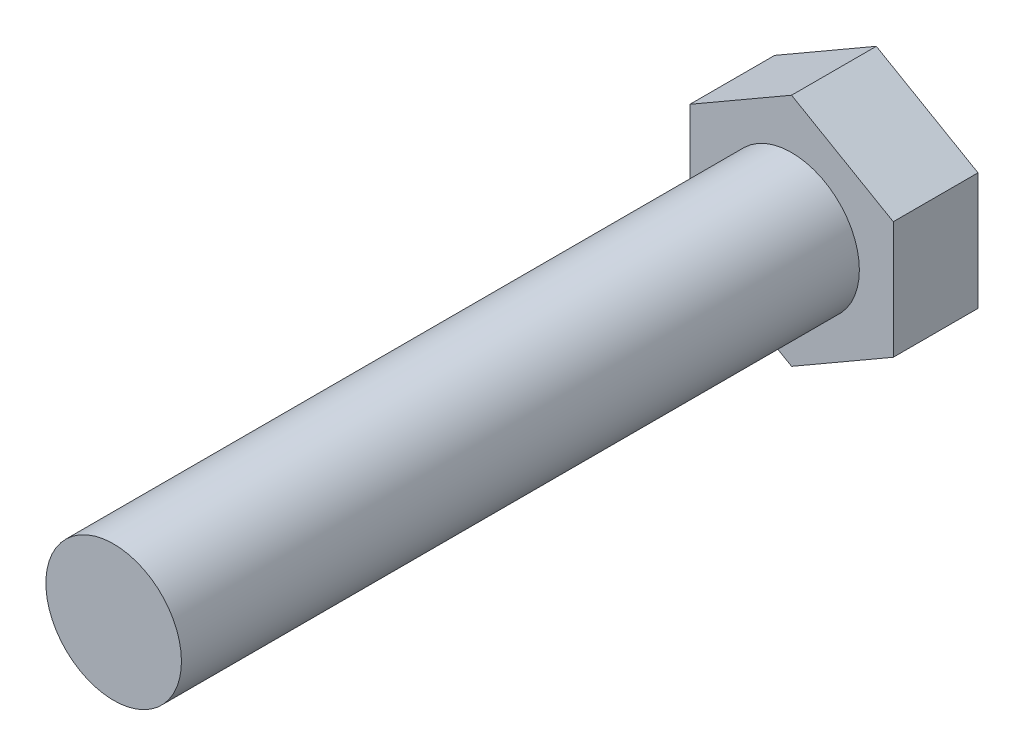
ISO-10303-21;
HEADER;
FILE_DESCRIPTION(('STEP AP214'),'2;1');
FILE_NAME('part.step','',(''),(''),'','','');
FILE_SCHEMA(('AUTOMOTIVE_DESIGN { 1 0 10303 214 1 1 1 1 }'));
ENDSEC;
DATA;
#1=APPLICATION_CONTEXT('core data for automotive mechanical design processes');
#2=APPLICATION_PROTOCOL_DEFINITION('international standard','automotive_design',2000,#1);
#3=PRODUCT_CONTEXT('',#1,'mechanical');
#4=PRODUCT('Part','Part','',(#3));
#5=PRODUCT_RELATED_PRODUCT_CATEGORY('part','',(#4));
#6=PRODUCT_DEFINITION_FORMATION('','',#4);
#7=PRODUCT_DEFINITION_CONTEXT('part definition',#1,'design');
#8=PRODUCT_DEFINITION('design','',#6,#7);
#9=PRODUCT_DEFINITION_SHAPE('','',#8);
#10=(LENGTH_UNIT() NAMED_UNIT(*) SI_UNIT(.MILLI.,.METRE.));
#11=(NAMED_UNIT(*) PLANE_ANGLE_UNIT() SI_UNIT($,.RADIAN.));
#12=(NAMED_UNIT(*) SI_UNIT($,.STERADIAN.) SOLID_ANGLE_UNIT());
#13=UNCERTAINTY_MEASURE_WITH_UNIT(LENGTH_MEASURE(1.E-05),#10,'distance_accuracy_value','');
#14=(GEOMETRIC_REPRESENTATION_CONTEXT(3) GLOBAL_UNCERTAINTY_ASSIGNED_CONTEXT((#13)) GLOBAL_UNIT_ASSIGNED_CONTEXT((#10,
#11,#12)) REPRESENTATION_CONTEXT('',''));
#15=CARTESIAN_POINT('',(0.,0.,0.));
#16=DIRECTION('',(0.,0.,1.));
#17=DIRECTION('',(1.,0.,0.));
#18=AXIS2_PLACEMENT_3D('',#15,#16,#17);
#19=CARTESIAN_POINT('',(15.,-8.66025403784438,12.5));
#20=DIRECTION('',(-1.,0.,0.));
#21=DIRECTION('',(0.,-1.,0.));
#22=AXIS2_PLACEMENT_3D('',#19,#20,#21);
#23=PLANE('',#22);
#24=DIRECTION('',(0.,1.,0.));
#25=VECTOR('',#24,1.);
#26=CARTESIAN_POINT('',(15.,-8.66025403784438,0.));
#27=LINE('',#26,#25);
#28=CARTESIAN_POINT('',(15.,-8.66025403784438,0.));
#29=VERTEX_POINT('',#28);
#30=CARTESIAN_POINT('',(15.,8.66025403784439,0.));
#31=VERTEX_POINT('',#30);
#32=EDGE_CURVE('E119',#29,#31,#27,.T.);
#33=ORIENTED_EDGE('',*,*,#32,.T.);
#34=DIRECTION('',(0.,0.,-1.));
#35=VECTOR('',#34,1.);
#36=CARTESIAN_POINT('',(15.,8.66025403784439,12.5));
#37=LINE('',#36,#35);
#38=CARTESIAN_POINT('',(15.,8.66025403784439,12.5));
#39=VERTEX_POINT('',#38);
#40=EDGE_CURVE('E36',#39,#31,#37,.T.);
#41=ORIENTED_EDGE('',*,*,#40,.F.);
#42=DIRECTION('',(0.,1.,0.));
#43=VECTOR('',#42,1.);
#44=CARTESIAN_POINT('',(15.,-8.66025403784438,12.5));
#45=LINE('',#44,#43);
#46=CARTESIAN_POINT('',(15.,-8.66025403784438,12.5));
#47=VERTEX_POINT('',#46);
#48=EDGE_CURVE('E130',#47,#39,#45,.T.);
#49=ORIENTED_EDGE('',*,*,#48,.F.);
#50=DIRECTION('',(0.,0.,-1.));
#51=VECTOR('',#50,1.);
#52=CARTESIAN_POINT('',(15.,-8.66025403784438,12.5));
#53=LINE('',#52,#51);
#54=EDGE_CURVE('E115',#47,#29,#53,.T.);
#55=ORIENTED_EDGE('',*,*,#54,.T.);
#56=EDGE_LOOP('',(#33,#41,#49,#55));
#57=FACE_BOUND('',#56,.T.);
#58=ADVANCED_FACE('F33',(#57),#23,.F.);
#59=CARTESIAN_POINT('',(15.,8.66025403784439,12.5));
#60=DIRECTION('',(-0.5,-0.866025403784439,0.));
#61=DIRECTION('',(0.866025403784439,-0.5,0.));
#62=AXIS2_PLACEMENT_3D('',#59,#60,#61);
#63=PLANE('',#62);
#64=DIRECTION('',(-0.866025403784439,0.5,0.));
#65=VECTOR('',#64,1.);
#66=CARTESIAN_POINT('',(15.,8.66025403784439,0.));
#67=LINE('',#66,#65);
#68=CARTESIAN_POINT('',(0.,17.3205080756888,0.));
#69=VERTEX_POINT('',#68);
#70=EDGE_CURVE('E122',#31,#69,#67,.T.);
#71=ORIENTED_EDGE('',*,*,#70,.T.);
#72=DIRECTION('',(0.,0.,-1.));
#73=VECTOR('',#72,1.);
#74=CARTESIAN_POINT('',(0.,17.3205080756888,12.5));
#75=LINE('',#74,#73);
#76=CARTESIAN_POINT('',(0.,17.3205080756888,12.5));
#77=VERTEX_POINT('',#76);
#78=EDGE_CURVE('E133',#77,#69,#75,.T.);
#79=ORIENTED_EDGE('',*,*,#78,.F.);
#80=DIRECTION('',(-0.866025403784439,0.5,0.));
#81=VECTOR('',#80,1.);
#82=CARTESIAN_POINT('',(15.,8.66025403784439,12.5));
#83=LINE('',#82,#81);
#84=EDGE_CURVE('E88',#39,#77,#83,.T.);
#85=ORIENTED_EDGE('',*,*,#84,.F.);
#86=ORIENTED_EDGE('',*,*,#40,.T.);
#87=EDGE_LOOP('',(#71,#79,#85,#86));
#88=FACE_BOUND('',#87,.T.);
#89=ADVANCED_FACE('F138',(#88),#63,.F.);
#90=CARTESIAN_POINT('',(0.,17.3205080756888,12.5));
#91=DIRECTION('',(0.5,-0.866025403784438,0.));
#92=DIRECTION('',(0.866025403784439,0.5,0.));
#93=AXIS2_PLACEMENT_3D('',#90,#91,#92);
#94=PLANE('',#93);
#95=DIRECTION('',(-0.866025403784438,-0.5,0.));
#96=VECTOR('',#95,1.);
#97=CARTESIAN_POINT('',(0.,17.3205080756888,0.));
#98=LINE('',#97,#96);
#99=CARTESIAN_POINT('',(-15.,8.66025403784438,0.));
#100=VERTEX_POINT('',#99);
#101=EDGE_CURVE('E125',#69,#100,#98,.T.);
#102=ORIENTED_EDGE('',*,*,#101,.T.);
#103=DIRECTION('',(0.,0.,-1.));
#104=VECTOR('',#103,1.);
#105=CARTESIAN_POINT('',(-15.,8.66025403784438,12.5));
#106=LINE('',#105,#104);
#107=CARTESIAN_POINT('',(-15.,8.66025403784438,12.5));
#108=VERTEX_POINT('',#107);
#109=EDGE_CURVE('E110',#108,#100,#106,.T.);
#110=ORIENTED_EDGE('',*,*,#109,.F.);
#111=DIRECTION('',(-0.866025403784438,-0.5,0.));
#112=VECTOR('',#111,1.);
#113=CARTESIAN_POINT('',(0.,17.3205080756888,12.5));
#114=LINE('',#113,#112);
#115=EDGE_CURVE('E101',#77,#108,#114,.T.);
#116=ORIENTED_EDGE('',*,*,#115,.F.);
#117=ORIENTED_EDGE('',*,*,#78,.T.);
#118=EDGE_LOOP('',(#102,#110,#116,#117));
#119=FACE_BOUND('',#118,.T.);
#120=ADVANCED_FACE('F144',(#119),#94,.F.);
#121=CARTESIAN_POINT('',(-15.,8.66025403784438,12.5));
#122=DIRECTION('',(1.,0.,0.));
#123=DIRECTION('',(0.,1.,0.));
#124=AXIS2_PLACEMENT_3D('',#121,#122,#123);
#125=PLANE('',#124);
#126=DIRECTION('',(0.,-1.,0.));
#127=VECTOR('',#126,1.);
#128=CARTESIAN_POINT('',(-15.,8.66025403784438,0.));
#129=LINE('',#128,#127);
#130=CARTESIAN_POINT('',(-15.,-8.66025403784438,0.));
#131=VERTEX_POINT('',#130);
#132=EDGE_CURVE('E109',#100,#131,#129,.T.);
#133=ORIENTED_EDGE('',*,*,#132,.T.);
#134=DIRECTION('',(0.,0.,-1.));
#135=VECTOR('',#134,1.);
#136=CARTESIAN_POINT('',(-15.,-8.66025403784438,12.5));
#137=LINE('',#136,#135);
#138=CARTESIAN_POINT('',(-15.,-8.66025403784438,12.5));
#139=VERTEX_POINT('',#138);
#140=EDGE_CURVE('E106',#139,#131,#137,.T.);
#141=ORIENTED_EDGE('',*,*,#140,.F.);
#142=DIRECTION('',(0.,-1.,0.));
#143=VECTOR('',#142,1.);
#144=CARTESIAN_POINT('',(-15.,8.66025403784438,12.5));
#145=LINE('',#144,#143);
#146=EDGE_CURVE('E95',#108,#139,#145,.T.);
#147=ORIENTED_EDGE('',*,*,#146,.F.);
#148=ORIENTED_EDGE('',*,*,#109,.T.);
#149=EDGE_LOOP('',(#133,#141,#147,#148));
#150=FACE_BOUND('',#149,.T.);
#151=ADVANCED_FACE('F107',(#150),#125,.F.);
#152=CARTESIAN_POINT('',(-15.,-8.66025403784438,12.5));
#153=DIRECTION('',(0.5,0.866025403784439,0.));
#154=DIRECTION('',(-0.866025403784439,0.5,0.));
#155=AXIS2_PLACEMENT_3D('',#152,#153,#154);
#156=PLANE('',#155);
#157=DIRECTION('',(0.866025403784439,-0.5,0.));
#158=VECTOR('',#157,1.);
#159=CARTESIAN_POINT('',(-15.,-8.66025403784438,0.));
#160=LINE('',#159,#158);
#161=CARTESIAN_POINT('',(0.,-17.3205080756888,0.));
#162=VERTEX_POINT('',#161);
#163=EDGE_CURVE('E73',#131,#162,#160,.T.);
#164=ORIENTED_EDGE('',*,*,#163,.T.);
#165=DIRECTION('',(0.,0.,-1.));
#166=VECTOR('',#165,1.);
#167=CARTESIAN_POINT('',(0.,-17.3205080756888,12.5));
#168=LINE('',#167,#166);
#169=CARTESIAN_POINT('',(0.,-17.3205080756888,12.5));
#170=VERTEX_POINT('',#169);
#171=EDGE_CURVE('E111',#170,#162,#168,.T.);
#172=ORIENTED_EDGE('',*,*,#171,.F.);
#173=DIRECTION('',(0.866025403784439,-0.5,0.));
#174=VECTOR('',#173,1.);
#175=CARTESIAN_POINT('',(-15.,-8.66025403784438,12.5));
#176=LINE('',#175,#174);
#177=EDGE_CURVE('E99',#139,#170,#176,.T.);
#178=ORIENTED_EDGE('',*,*,#177,.F.);
#179=ORIENTED_EDGE('',*,*,#140,.T.);
#180=EDGE_LOOP('',(#164,#172,#178,#179));
#181=FACE_BOUND('',#180,.T.);
#182=ADVANCED_FACE('F113',(#181),#156,.F.);
#183=CARTESIAN_POINT('',(0.,-17.3205080756888,12.5));
#184=DIRECTION('',(-0.5,0.866025403784438,0.));
#185=DIRECTION('',(-0.866025403784438,-0.5,0.));
#186=AXIS2_PLACEMENT_3D('',#183,#184,#185);
#187=PLANE('',#186);
#188=DIRECTION('',(0.866025403784439,0.5,0.));
#189=VECTOR('',#188,1.);
#190=CARTESIAN_POINT('',(0.,-17.3205080756888,0.));
#191=LINE('',#190,#189);
#192=EDGE_CURVE('E79',#162,#29,#191,.T.);
#193=ORIENTED_EDGE('',*,*,#192,.T.);
#194=ORIENTED_EDGE('',*,*,#54,.F.);
#195=DIRECTION('',(0.866025403784439,0.5,0.));
#196=VECTOR('',#195,1.);
#197=CARTESIAN_POINT('',(0.,-17.3205080756888,12.5));
#198=LINE('',#197,#196);
#199=EDGE_CURVE('E50',#170,#47,#198,.T.);
#200=ORIENTED_EDGE('',*,*,#199,.F.);
#201=ORIENTED_EDGE('',*,*,#171,.T.);
#202=EDGE_LOOP('',(#193,#194,#200,#201));
#203=FACE_BOUND('',#202,.T.);
#204=ADVANCED_FACE('F160',(#203),#187,.F.);
#205=CARTESIAN_POINT('',(0.,0.,12.5));
#206=DIRECTION('',(0.,0.,1.));
#207=DIRECTION('',(1.,0.,0.));
#208=AXIS2_PLACEMENT_3D('',#205,#206,#207);
#209=PLANE('',#208);
#210=CARTESIAN_POINT('',(0.,0.,12.5));
#211=DIRECTION('',(0.,0.,1.));
#212=DIRECTION('',(1.,0.,0.));
#213=AXIS2_PLACEMENT_3D('',#210,#211,#212);
#214=CIRCLE('',#213,10.);
#215=CARTESIAN_POINT('',(10.,0.,12.5));
#216=VERTEX_POINT('',#215);
#217=EDGE_CURVE('E11',#216,#216,#214,.T.);
#218=ORIENTED_EDGE('',*,*,#217,.F.);
#219=EDGE_LOOP('',(#218));
#220=FACE_BOUND('',#219,.T.);
#221=ORIENTED_EDGE('',*,*,#48,.T.);
#222=ORIENTED_EDGE('',*,*,#84,.T.);
#223=ORIENTED_EDGE('',*,*,#115,.T.);
#224=ORIENTED_EDGE('',*,*,#146,.T.);
#225=ORIENTED_EDGE('',*,*,#177,.T.);
#226=ORIENTED_EDGE('',*,*,#199,.T.);
#227=EDGE_LOOP('',(#221,#222,#223,#224,#225,#226));
#228=FACE_BOUND('',#227,.T.);
#229=ADVANCED_FACE('F97',(#220,#228),#209,.T.);
#230=CARTESIAN_POINT('',(0.,0.,0.));
#231=DIRECTION('',(0.,0.,1.));
#232=DIRECTION('',(1.,0.,0.));
#233=AXIS2_PLACEMENT_3D('',#230,#231,#232);
#234=PLANE('',#233);
#235=ORIENTED_EDGE('',*,*,#32,.F.);
#236=ORIENTED_EDGE('',*,*,#192,.F.);
#237=ORIENTED_EDGE('',*,*,#163,.F.);
#238=ORIENTED_EDGE('',*,*,#132,.F.);
#239=ORIENTED_EDGE('',*,*,#101,.F.);
#240=ORIENTED_EDGE('',*,*,#70,.F.);
#241=EDGE_LOOP('',(#235,#236,#237,#238,#239,#240));
#242=FACE_BOUND('',#241,.T.);
#243=ADVANCED_FACE('F143',(#242),#234,.F.);
#244=CARTESIAN_POINT('',(0.,0.,112.5));
#245=DIRECTION('',(0.,0.,-1.));
#246=DIRECTION('',(-1.,0.,0.));
#247=AXIS2_PLACEMENT_3D('',#244,#245,#246);
#248=CYLINDRICAL_SURFACE('',#247,10.);
#249=CARTESIAN_POINT('',(0.,0.,112.5));
#250=DIRECTION('',(0.,0.,1.));
#251=DIRECTION('',(1.,0.,0.));
#252=AXIS2_PLACEMENT_3D('',#249,#250,#251);
#253=CIRCLE('',#252,10.);
#254=CARTESIAN_POINT('',(10.,0.,112.5));
#255=VERTEX_POINT('',#254);
#256=EDGE_CURVE('E123',#255,#255,#253,.T.);
#257=ORIENTED_EDGE('',*,*,#256,.F.);
#258=EDGE_LOOP('',(#257));
#259=FACE_BOUND('',#258,.T.);
#260=ORIENTED_EDGE('',*,*,#217,.T.);
#261=EDGE_LOOP('',(#260));
#262=FACE_BOUND('',#261,.T.);
#263=ADVANCED_FACE('F153',(#259,#262),#248,.T.);
#264=CARTESIAN_POINT('',(0.,0.,112.5));
#265=DIRECTION('',(0.,0.,1.));
#266=DIRECTION('',(1.,0.,0.));
#267=AXIS2_PLACEMENT_3D('',#264,#265,#266);
#268=PLANE('',#267);
#269=ORIENTED_EDGE('',*,*,#256,.T.);
#270=EDGE_LOOP('',(#269));
#271=FACE_BOUND('',#270,.T.);
#272=ADVANCED_FACE('F151',(#271),#268,.T.);
#273=CLOSED_SHELL('',(#58,#89,#120,#151,#182,#204,#229,#243,#263,#272));
#274=MANIFOLD_SOLID_BREP('B2',#273);
#275=ADVANCED_BREP_SHAPE_REPRESENTATION('',(#18,#274),#14);
#276=SHAPE_DEFINITION_REPRESENTATION(#9,#275);
ENDSEC;
END-ISO-10303-21;
